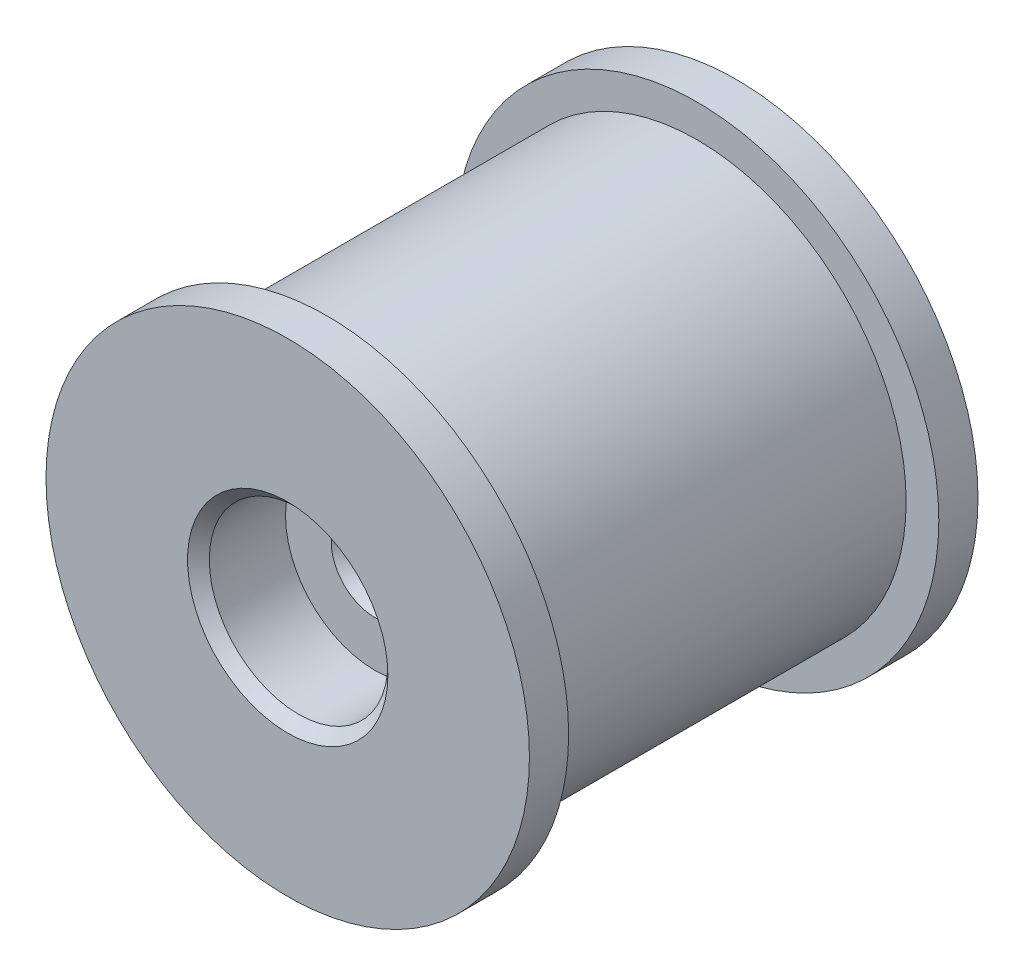
ISO-10303-21;
HEADER;
FILE_DESCRIPTION(('STEP AP214'),'2;1');
FILE_NAME('part.step','',(''),(''),'','','');
FILE_SCHEMA(('AUTOMOTIVE_DESIGN { 1 0 10303 214 1 1 1 1 }'));
ENDSEC;
DATA;
#1=APPLICATION_CONTEXT('core data for automotive mechanical design processes');
#2=APPLICATION_PROTOCOL_DEFINITION('international standard','automotive_design',2000,#1);
#3=PRODUCT_CONTEXT('',#1,'mechanical');
#4=PRODUCT('Part','Part','',(#3));
#5=PRODUCT_RELATED_PRODUCT_CATEGORY('part','',(#4));
#6=PRODUCT_DEFINITION_FORMATION('','',#4);
#7=PRODUCT_DEFINITION_CONTEXT('part definition',#1,'design');
#8=PRODUCT_DEFINITION('design','',#6,#7);
#9=PRODUCT_DEFINITION_SHAPE('','',#8);
#10=(LENGTH_UNIT() NAMED_UNIT(*) SI_UNIT(.MILLI.,.METRE.));
#11=(NAMED_UNIT(*) PLANE_ANGLE_UNIT() SI_UNIT($,.RADIAN.));
#12=(NAMED_UNIT(*) SI_UNIT($,.STERADIAN.) SOLID_ANGLE_UNIT());
#13=UNCERTAINTY_MEASURE_WITH_UNIT(LENGTH_MEASURE(1.E-05),#10,'distance_accuracy_value','');
#14=(GEOMETRIC_REPRESENTATION_CONTEXT(3) GLOBAL_UNCERTAINTY_ASSIGNED_CONTEXT((#13)) GLOBAL_UNIT_ASSIGNED_CONTEXT((#10,
#11,#12)) REPRESENTATION_CONTEXT('',''));
#15=CARTESIAN_POINT('',(0.,0.,0.));
#16=DIRECTION('',(0.,0.,1.));
#17=DIRECTION('',(1.,0.,0.));
#18=AXIS2_PLACEMENT_3D('',#15,#16,#17);
#19=CARTESIAN_POINT('',(0.,0.,-10.3));
#20=DIRECTION('',(0.,0.,1.));
#21=DIRECTION('',(1.,0.,0.));
#22=AXIS2_PLACEMENT_3D('',#19,#20,#21);
#23=CYLINDRICAL_SURFACE('',#22,9.6);
#24=CARTESIAN_POINT('',(0.,0.,8.5));
#25=DIRECTION('',(0.,0.,1.));
#26=DIRECTION('',(1.,0.,0.));
#27=AXIS2_PLACEMENT_3D('',#24,#25,#26);
#28=CIRCLE('',#27,9.6);
#29=CARTESIAN_POINT('',(9.6,0.,8.5));
#30=VERTEX_POINT('',#29);
#31=EDGE_CURVE('E60',#30,#30,#28,.F.);
#32=ORIENTED_EDGE('',*,*,#31,.T.);
#33=EDGE_LOOP('',(#32));
#34=FACE_BOUND('',#33,.T.);
#35=CARTESIAN_POINT('',(0.,0.,-8.5));
#36=DIRECTION('',(0.,0.,-1.));
#37=DIRECTION('',(-1.,0.,0.));
#38=AXIS2_PLACEMENT_3D('',#35,#36,#37);
#39=CIRCLE('',#38,9.6);
#40=CARTESIAN_POINT('',(-9.6,0.,-8.5));
#41=VERTEX_POINT('',#40);
#42=EDGE_CURVE('E61',#41,#41,#39,.F.);
#43=ORIENTED_EDGE('',*,*,#42,.T.);
#44=EDGE_LOOP('',(#43));
#45=FACE_BOUND('',#44,.T.);
#46=ADVANCED_FACE('F34',(#34,#45),#23,.T.);
#47=CARTESIAN_POINT('',(0.,0.,8.5));
#48=DIRECTION('',(0.,0.,1.));
#49=DIRECTION('',(1.,0.,0.));
#50=AXIS2_PLACEMENT_3D('',#47,#48,#49);
#51=CYLINDRICAL_SURFACE('',#50,11.1);
#52=CARTESIAN_POINT('',(0.,0.,8.5));
#53=DIRECTION('',(0.,0.,1.));
#54=DIRECTION('',(1.,0.,0.));
#55=AXIS2_PLACEMENT_3D('',#52,#53,#54);
#56=CIRCLE('',#55,11.1);
#57=CARTESIAN_POINT('',(11.1,0.,8.5));
#58=VERTEX_POINT('',#57);
#59=EDGE_CURVE('E68',#58,#58,#56,.T.);
#60=ORIENTED_EDGE('',*,*,#59,.T.);
#61=EDGE_LOOP('',(#60));
#62=FACE_BOUND('',#61,.T.);
#63=CARTESIAN_POINT('',(0.,0.,10.3));
#64=DIRECTION('',(0.,0.,1.));
#65=DIRECTION('',(1.,0.,0.));
#66=AXIS2_PLACEMENT_3D('',#63,#64,#65);
#67=CIRCLE('',#66,11.1);
#68=CARTESIAN_POINT('',(11.1,0.,10.3));
#69=VERTEX_POINT('',#68);
#70=EDGE_CURVE('E64',#69,#69,#67,.T.);
#71=ORIENTED_EDGE('',*,*,#70,.F.);
#72=EDGE_LOOP('',(#71));
#73=FACE_BOUND('',#72,.T.);
#74=ADVANCED_FACE('F108',(#62,#73),#51,.T.);
#75=CARTESIAN_POINT('',(0.,0.,8.5));
#76=DIRECTION('',(0.,0.,1.));
#77=DIRECTION('',(1.,0.,0.));
#78=AXIS2_PLACEMENT_3D('',#75,#76,#77);
#79=PLANE('',#78);
#80=ORIENTED_EDGE('',*,*,#31,.F.);
#81=EDGE_LOOP('',(#80));
#82=FACE_BOUND('',#81,.T.);
#83=ORIENTED_EDGE('',*,*,#59,.F.);
#84=EDGE_LOOP('',(#83));
#85=FACE_BOUND('',#84,.T.);
#86=ADVANCED_FACE('F114',(#82,#85),#79,.F.);
#87=CARTESIAN_POINT('',(0.,0.,10.3));
#88=DIRECTION('',(0.,0.,1.));
#89=DIRECTION('',(1.,0.,0.));
#90=AXIS2_PLACEMENT_3D('',#87,#88,#89);
#91=PLANE('',#90);
#92=CARTESIAN_POINT('',(0.,0.,10.3));
#93=DIRECTION('',(0.,0.,1.));
#94=DIRECTION('',(1.,0.,0.));
#95=AXIS2_PLACEMENT_3D('',#92,#93,#94);
#96=CIRCLE('',#95,4.6);
#97=CARTESIAN_POINT('',(4.6,0.,10.3));
#98=VERTEX_POINT('',#97);
#99=EDGE_CURVE('E57',#98,#98,#96,.F.);
#100=ORIENTED_EDGE('',*,*,#99,.T.);
#101=EDGE_LOOP('',(#100));
#102=FACE_BOUND('',#101,.T.);
#103=ORIENTED_EDGE('',*,*,#70,.T.);
#104=EDGE_LOOP('',(#103));
#105=FACE_BOUND('',#104,.T.);
#106=ADVANCED_FACE('F180',(#102,#105),#91,.T.);
#107=CARTESIAN_POINT('',(0.,0.,-8.5));
#108=DIRECTION('',(0.,0.,-1.));
#109=DIRECTION('',(-1.,0.,0.));
#110=AXIS2_PLACEMENT_3D('',#107,#108,#109);
#111=CYLINDRICAL_SURFACE('',#110,11.1);
#112=CARTESIAN_POINT('',(0.,0.,-8.5));
#113=DIRECTION('',(0.,0.,-1.));
#114=DIRECTION('',(-1.,0.,0.));
#115=AXIS2_PLACEMENT_3D('',#112,#113,#114);
#116=CIRCLE('',#115,11.1);
#117=CARTESIAN_POINT('',(-11.1,0.,-8.5));
#118=VERTEX_POINT('',#117);
#119=EDGE_CURVE('E65',#118,#118,#116,.T.);
#120=ORIENTED_EDGE('',*,*,#119,.T.);
#121=EDGE_LOOP('',(#120));
#122=FACE_BOUND('',#121,.T.);
#123=CARTESIAN_POINT('',(0.,0.,-10.3));
#124=DIRECTION('',(0.,0.,-1.));
#125=DIRECTION('',(-1.,0.,0.));
#126=AXIS2_PLACEMENT_3D('',#123,#124,#125);
#127=CIRCLE('',#126,11.1);
#128=CARTESIAN_POINT('',(-11.1,0.,-10.3));
#129=VERTEX_POINT('',#128);
#130=EDGE_CURVE('E73',#129,#129,#127,.T.);
#131=ORIENTED_EDGE('',*,*,#130,.F.);
#132=EDGE_LOOP('',(#131));
#133=FACE_BOUND('',#132,.T.);
#134=ADVANCED_FACE('F185',(#122,#133),#111,.T.);
#135=CARTESIAN_POINT('',(0.,0.,-8.5));
#136=DIRECTION('',(0.,0.,-1.));
#137=DIRECTION('',(-1.,0.,0.));
#138=AXIS2_PLACEMENT_3D('',#135,#136,#137);
#139=PLANE('',#138);
#140=ORIENTED_EDGE('',*,*,#42,.F.);
#141=EDGE_LOOP('',(#140));
#142=FACE_BOUND('',#141,.T.);
#143=ORIENTED_EDGE('',*,*,#119,.F.);
#144=EDGE_LOOP('',(#143));
#145=FACE_BOUND('',#144,.T.);
#146=ADVANCED_FACE('F216',(#142,#145),#139,.F.);
#147=CARTESIAN_POINT('',(0.,0.,-10.3));
#148=DIRECTION('',(0.,0.,1.));
#149=DIRECTION('',(1.,0.,0.));
#150=AXIS2_PLACEMENT_3D('',#147,#148,#149);
#151=PLANE('',#150);
#152=CARTESIAN_POINT('',(0.,0.,-10.3));
#153=DIRECTION('',(0.,0.,-1.));
#154=DIRECTION('',(-1.,0.,0.));
#155=AXIS2_PLACEMENT_3D('',#152,#153,#154);
#156=CIRCLE('',#155,8.);
#157=CARTESIAN_POINT('',(-8.,0.,-10.3));
#158=VERTEX_POINT('',#157);
#159=EDGE_CURVE('E76',#158,#158,#156,.T.);
#160=ORIENTED_EDGE('',*,*,#159,.F.);
#161=EDGE_LOOP('',(#160));
#162=FACE_BOUND('',#161,.T.);
#163=ORIENTED_EDGE('',*,*,#130,.T.);
#164=EDGE_LOOP('',(#163));
#165=FACE_BOUND('',#164,.T.);
#166=ADVANCED_FACE('F120',(#162,#165),#151,.F.);
#167=CARTESIAN_POINT('',(0.,0.,-9.8));
#168=DIRECTION('',(0.,0.,-1.));
#169=DIRECTION('',(-1.,0.,0.));
#170=AXIS2_PLACEMENT_3D('',#167,#168,#169);
#171=CYLINDRICAL_SURFACE('',#170,8.);
#172=CARTESIAN_POINT('',(0.,0.,-8.5));
#173=DIRECTION('',(0.,0.,-1.));
#174=DIRECTION('',(-1.,0.,0.));
#175=AXIS2_PLACEMENT_3D('',#172,#173,#174);
#176=CIRCLE('',#175,8.);
#177=CARTESIAN_POINT('',(-8.,0.,-8.5));
#178=VERTEX_POINT('',#177);
#179=EDGE_CURVE('E81',#178,#178,#176,.T.);
#180=ORIENTED_EDGE('',*,*,#179,.F.);
#181=EDGE_LOOP('',(#180));
#182=FACE_BOUND('',#181,.T.);
#183=ORIENTED_EDGE('',*,*,#159,.T.);
#184=EDGE_LOOP('',(#183));
#185=FACE_BOUND('',#184,.T.);
#186=ADVANCED_FACE('F197',(#182,#185),#171,.F.);
#187=CARTESIAN_POINT('',(0.,0.,-8.5));
#188=DIRECTION('',(0.,0.,-1.));
#189=DIRECTION('',(-1.,0.,0.));
#190=AXIS2_PLACEMENT_3D('',#187,#188,#189);
#191=CONICAL_SURFACE('',#190,8.,0.176708856070037);
#192=CARTESIAN_POINT('',(0.,0.,2.7));
#193=DIRECTION('',(0.,0.,-1.));
#194=DIRECTION('',(-1.,0.,0.));
#195=AXIS2_PLACEMENT_3D('',#192,#193,#194);
#196=CIRCLE('',#195,6.);
#197=CARTESIAN_POINT('',(-6.,0.,2.7));
#198=VERTEX_POINT('',#197);
#199=EDGE_CURVE('E84',#198,#198,#196,.T.);
#200=ORIENTED_EDGE('',*,*,#199,.F.);
#201=EDGE_LOOP('',(#200));
#202=FACE_BOUND('',#201,.T.);
#203=ORIENTED_EDGE('',*,*,#179,.T.);
#204=EDGE_LOOP('',(#203));
#205=FACE_BOUND('',#204,.T.);
#206=ADVANCED_FACE('F173',(#202,#205),#191,.F.);
#207=CARTESIAN_POINT('',(0.,6.,2.7));
#208=DIRECTION('',(0.,0.,1.));
#209=DIRECTION('',(1.,0.,0.));
#210=AXIS2_PLACEMENT_3D('',#207,#208,#209);
#211=PLANE('',#210);
#212=CARTESIAN_POINT('',(0.,0.,2.7));
#213=DIRECTION('',(0.,0.,1.));
#214=DIRECTION('',(1.,0.,0.));
#215=AXIS2_PLACEMENT_3D('',#212,#213,#214);
#216=CIRCLE('',#215,2.);
#217=CARTESIAN_POINT('',(2.,0.,2.7));
#218=VERTEX_POINT('',#217);
#219=EDGE_CURVE('E10',#218,#218,#216,.T.);
#220=ORIENTED_EDGE('',*,*,#219,.T.);
#221=EDGE_LOOP('',(#220));
#222=FACE_BOUND('',#221,.T.);
#223=ORIENTED_EDGE('',*,*,#199,.T.);
#224=EDGE_LOOP('',(#223));
#225=FACE_BOUND('',#224,.T.);
#226=ADVANCED_FACE('F105',(#222,#225),#211,.F.);
#227=CARTESIAN_POINT('',(0.,0.,-9.8));
#228=DIRECTION('',(0.,0.,-1.));
#229=DIRECTION('',(-1.,0.,0.));
#230=AXIS2_PLACEMENT_3D('',#227,#228,#229);
#231=CYLINDRICAL_SURFACE('',#230,1.5);
#232=CARTESIAN_POINT('',(0.,0.,5.8));
#233=DIRECTION('',(0.,0.,-1.));
#234=DIRECTION('',(-1.,0.,0.));
#235=AXIS2_PLACEMENT_3D('',#232,#233,#234);
#236=CIRCLE('',#235,1.5);
#237=CARTESIAN_POINT('',(-1.5,0.,5.8));
#238=VERTEX_POINT('',#237);
#239=EDGE_CURVE('E41',#238,#238,#236,.F.);
#240=ORIENTED_EDGE('',*,*,#239,.T.);
#241=EDGE_LOOP('',(#240));
#242=FACE_BOUND('',#241,.T.);
#243=CARTESIAN_POINT('',(0.,0.,3.2));
#244=DIRECTION('',(0.,0.,1.));
#245=DIRECTION('',(1.,0.,0.));
#246=AXIS2_PLACEMENT_3D('',#243,#244,#245);
#247=CIRCLE('',#246,1.5);
#248=CARTESIAN_POINT('',(1.5,0.,3.2));
#249=VERTEX_POINT('',#248);
#250=EDGE_CURVE('E45',#249,#249,#247,.F.);
#251=ORIENTED_EDGE('',*,*,#250,.T.);
#252=EDGE_LOOP('',(#251));
#253=FACE_BOUND('',#252,.T.);
#254=ADVANCED_FACE('F95',(#242,#253),#231,.F.);
#255=CARTESIAN_POINT('',(0.,1.5,6.3));
#256=DIRECTION('',(0.,0.,-1.));
#257=DIRECTION('',(-1.,0.,0.));
#258=AXIS2_PLACEMENT_3D('',#255,#256,#257);
#259=PLANE('',#258);
#260=CARTESIAN_POINT('',(0.,0.,6.3));
#261=DIRECTION('',(0.,0.,-1.));
#262=DIRECTION('',(-1.,0.,0.));
#263=AXIS2_PLACEMENT_3D('',#260,#261,#262);
#264=CIRCLE('',#263,2.);
#265=CARTESIAN_POINT('',(-2.,0.,6.3));
#266=VERTEX_POINT('',#265);
#267=EDGE_CURVE('E49',#266,#266,#264,.T.);
#268=ORIENTED_EDGE('',*,*,#267,.T.);
#269=EDGE_LOOP('',(#268));
#270=FACE_BOUND('',#269,.T.);
#271=CARTESIAN_POINT('',(0.,0.,6.3));
#272=DIRECTION('',(0.,0.,-1.));
#273=DIRECTION('',(-1.,0.,0.));
#274=AXIS2_PLACEMENT_3D('',#271,#272,#273);
#275=CIRCLE('',#274,4.1);
#276=CARTESIAN_POINT('',(-4.1,0.,6.3));
#277=VERTEX_POINT('',#276);
#278=EDGE_CURVE('E87',#277,#277,#275,.T.);
#279=ORIENTED_EDGE('',*,*,#278,.F.);
#280=EDGE_LOOP('',(#279));
#281=FACE_BOUND('',#280,.T.);
#282=ADVANCED_FACE('F93',(#270,#281),#259,.F.);
#283=CARTESIAN_POINT('',(0.,0.,-9.8));
#284=DIRECTION('',(0.,0.,-1.));
#285=DIRECTION('',(-1.,0.,0.));
#286=AXIS2_PLACEMENT_3D('',#283,#284,#285);
#287=CYLINDRICAL_SURFACE('',#286,4.1);
#288=CARTESIAN_POINT('',(0.,0.,9.8));
#289=DIRECTION('',(0.,0.,1.));
#290=DIRECTION('',(1.,0.,0.));
#291=AXIS2_PLACEMENT_3D('',#288,#289,#290);
#292=CIRCLE('',#291,4.1);
#293=CARTESIAN_POINT('',(4.1,0.,9.8));
#294=VERTEX_POINT('',#293);
#295=EDGE_CURVE('E54',#294,#294,#292,.T.);
#296=ORIENTED_EDGE('',*,*,#295,.T.);
#297=EDGE_LOOP('',(#296));
#298=FACE_BOUND('',#297,.T.);
#299=ORIENTED_EDGE('',*,*,#278,.T.);
#300=EDGE_LOOP('',(#299));
#301=FACE_BOUND('',#300,.T.);
#302=ADVANCED_FACE('F91',(#298,#301),#287,.F.);
#303=CARTESIAN_POINT('',(0.,0.,10.3));
#304=DIRECTION('',(0.,0.,1.));
#305=DIRECTION('',(1.,0.,0.));
#306=AXIS2_PLACEMENT_3D('',#303,#304,#305);
#307=CONICAL_SURFACE('',#306,4.6,0.785398163397445);
#308=ORIENTED_EDGE('',*,*,#295,.F.);
#309=EDGE_LOOP('',(#308));
#310=FACE_BOUND('',#309,.T.);
#311=ORIENTED_EDGE('',*,*,#99,.F.);
#312=EDGE_LOOP('',(#311));
#313=FACE_BOUND('',#312,.T.);
#314=ADVANCED_FACE('F102',(#310,#313),#307,.F.);
#315=CARTESIAN_POINT('',(0.,0.,6.3));
#316=DIRECTION('',(0.,0.,1.));
#317=DIRECTION('',(1.,0.,0.));
#318=AXIS2_PLACEMENT_3D('',#315,#316,#317);
#319=CONICAL_SURFACE('',#318,2.,0.785398163397448);
#320=ORIENTED_EDGE('',*,*,#239,.F.);
#321=EDGE_LOOP('',(#320));
#322=FACE_BOUND('',#321,.T.);
#323=ORIENTED_EDGE('',*,*,#267,.F.);
#324=EDGE_LOOP('',(#323));
#325=FACE_BOUND('',#324,.T.);
#326=ADVANCED_FACE('F123',(#322,#325),#319,.F.);
#327=CARTESIAN_POINT('',(0.,0.,3.2));
#328=DIRECTION('',(0.,0.,-1.));
#329=DIRECTION('',(-1.,0.,0.));
#330=AXIS2_PLACEMENT_3D('',#327,#328,#329);
#331=CONICAL_SURFACE('',#330,1.5,0.78539816339745);
#332=ORIENTED_EDGE('',*,*,#219,.F.);
#333=EDGE_LOOP('',(#332));
#334=FACE_BOUND('',#333,.T.);
#335=ORIENTED_EDGE('',*,*,#250,.F.);
#336=EDGE_LOOP('',(#335));
#337=FACE_BOUND('',#336,.T.);
#338=ADVANCED_FACE('F36',(#334,#337),#331,.F.);
#339=CLOSED_SHELL('',(#46,#74,#86,#106,#134,#146,#166,#186,#206,#226,#254,#282,#302,#314,#326,#338));
#340=MANIFOLD_SOLID_BREP('B2',#339);
#341=ADVANCED_BREP_SHAPE_REPRESENTATION('',(#18,#340),#14);
#342=SHAPE_DEFINITION_REPRESENTATION(#9,#341);
ENDSEC;
END-ISO-10303-21;
